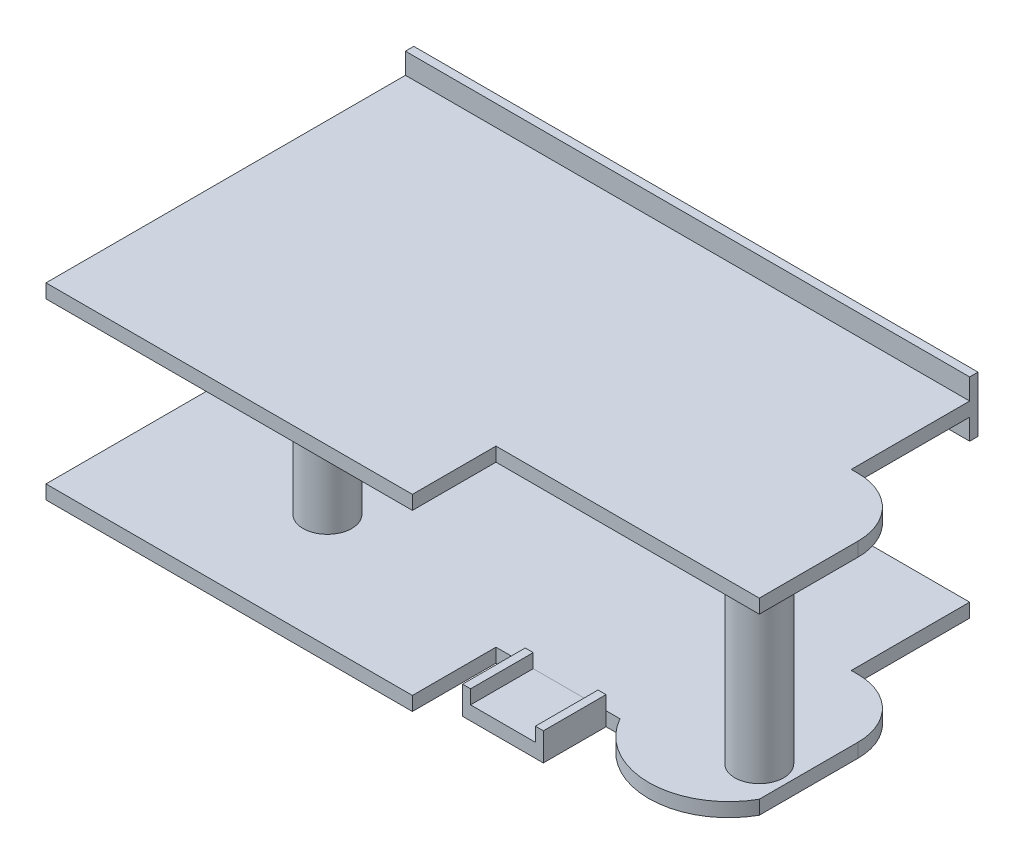
ISO-10303-21;
HEADER;
FILE_DESCRIPTION(('STEP AP214'),'2;1');
FILE_NAME('part.step','',(''),(''),'','','');
FILE_SCHEMA(('AUTOMOTIVE_DESIGN { 1 0 10303 214 1 1 1 1 }'));
ENDSEC;
DATA;
#1=APPLICATION_CONTEXT('core data for automotive mechanical design processes');
#2=APPLICATION_PROTOCOL_DEFINITION('international standard','automotive_design',2000,#1);
#3=PRODUCT_CONTEXT('',#1,'mechanical');
#4=PRODUCT('Part','Part','',(#3));
#5=PRODUCT_RELATED_PRODUCT_CATEGORY('part','',(#4));
#6=PRODUCT_DEFINITION_FORMATION('','',#4);
#7=PRODUCT_DEFINITION_CONTEXT('part definition',#1,'design');
#8=PRODUCT_DEFINITION('design','',#6,#7);
#9=PRODUCT_DEFINITION_SHAPE('','',#8);
#10=(LENGTH_UNIT() NAMED_UNIT(*) SI_UNIT(.MILLI.,.METRE.));
#11=(NAMED_UNIT(*) PLANE_ANGLE_UNIT() SI_UNIT($,.RADIAN.));
#12=(NAMED_UNIT(*) SI_UNIT($,.STERADIAN.) SOLID_ANGLE_UNIT());
#13=UNCERTAINTY_MEASURE_WITH_UNIT(LENGTH_MEASURE(1.E-05),#10,'distance_accuracy_value','');
#14=(GEOMETRIC_REPRESENTATION_CONTEXT(3) GLOBAL_UNCERTAINTY_ASSIGNED_CONTEXT((#13)) GLOBAL_UNIT_ASSIGNED_CONTEXT((#10,
#11,#12)) REPRESENTATION_CONTEXT('',''));
#15=CARTESIAN_POINT('',(0.,0.,0.));
#16=DIRECTION('',(0.,0.,1.));
#17=DIRECTION('',(1.,0.,0.));
#18=AXIS2_PLACEMENT_3D('',#15,#16,#17);
#19=CARTESIAN_POINT('',(289.75,10.,-15.));
#20=DIRECTION('',(0.,-1.,0.));
#21=DIRECTION('',(0.,0.,-1.));
#22=AXIS2_PLACEMENT_3D('',#19,#20,#21);
#23=PLANE('',#22);
#24=DIRECTION('',(-1.,0.,0.));
#25=VECTOR('',#24,1.);
#26=CARTESIAN_POINT('',(289.75,10.,-60.));
#27=LINE('',#26,#25);
#28=CARTESIAN_POINT('',(289.75,10.,-60.));
#29=VERTEX_POINT('',#28);
#30=CARTESIAN_POINT('',(284.,10.,-60.));
#31=VERTEX_POINT('',#30);
#32=EDGE_CURVE('E140',#29,#31,#27,.T.);
#33=ORIENTED_EDGE('',*,*,#32,.T.);
#34=DIRECTION('',(0.,0.,-1.));
#35=VECTOR('',#34,1.);
#36=CARTESIAN_POINT('',(284.,10.,-15.));
#37=LINE('',#36,#35);
#38=CARTESIAN_POINT('',(284.,10.,-15.));
#39=VERTEX_POINT('',#38);
#40=EDGE_CURVE('E12',#39,#31,#37,.T.);
#41=ORIENTED_EDGE('',*,*,#40,.F.);
#42=DIRECTION('',(-1.,0.,0.));
#43=VECTOR('',#42,1.);
#44=CARTESIAN_POINT('',(289.75,10.,-15.));
#45=LINE('',#44,#43);
#46=CARTESIAN_POINT('',(289.75,10.,-15.));
#47=VERTEX_POINT('',#46);
#48=EDGE_CURVE('E154',#47,#39,#45,.T.);
#49=ORIENTED_EDGE('',*,*,#48,.F.);
#50=DIRECTION('',(0.,0.,-1.));
#51=VECTOR('',#50,1.);
#52=CARTESIAN_POINT('',(289.75,10.,-15.));
#53=LINE('',#52,#51);
#54=EDGE_CURVE('E136',#47,#29,#53,.T.);
#55=ORIENTED_EDGE('',*,*,#54,.T.);
#56=EDGE_LOOP('',(#33,#41,#49,#55));
#57=FACE_BOUND('',#56,.T.);
#58=ADVANCED_FACE('F44',(#57),#23,.F.);
#59=CARTESIAN_POINT('',(284.,10.,-15.));
#60=DIRECTION('',(1.,0.,0.));
#61=DIRECTION('',(0.,0.,-1.));
#62=AXIS2_PLACEMENT_3D('',#59,#60,#61);
#63=PLANE('',#62);
#64=DIRECTION('',(0.,-1.,0.));
#65=VECTOR('',#64,1.);
#66=CARTESIAN_POINT('',(284.,10.,-60.));
#67=LINE('',#66,#65);
#68=CARTESIAN_POINT('',(284.,-10.,-60.));
#69=VERTEX_POINT('',#68);
#70=EDGE_CURVE('E143',#31,#69,#67,.T.);
#71=ORIENTED_EDGE('',*,*,#70,.T.);
#72=DIRECTION('',(0.,0.,-1.));
#73=VECTOR('',#72,1.);
#74=CARTESIAN_POINT('',(284.,-10.,-15.));
#75=LINE('',#74,#73);
#76=CARTESIAN_POINT('',(284.,-10.,-15.));
#77=VERTEX_POINT('',#76);
#78=EDGE_CURVE('E52',#77,#69,#75,.T.);
#79=ORIENTED_EDGE('',*,*,#78,.F.);
#80=DIRECTION('',(0.,-1.,0.));
#81=VECTOR('',#80,1.);
#82=CARTESIAN_POINT('',(284.,10.,-15.));
#83=LINE('',#82,#81);
#84=EDGE_CURVE('E103',#39,#77,#83,.T.);
#85=ORIENTED_EDGE('',*,*,#84,.F.);
#86=ORIENTED_EDGE('',*,*,#40,.T.);
#87=EDGE_LOOP('',(#71,#79,#85,#86));
#88=FACE_BOUND('',#87,.T.);
#89=ADVANCED_FACE('F189',(#88),#63,.F.);
#90=CARTESIAN_POINT('',(284.,-10.,-15.));
#91=DIRECTION('',(0.,1.,0.));
#92=DIRECTION('',(0.,0.,1.));
#93=AXIS2_PLACEMENT_3D('',#90,#91,#92);
#94=PLANE('',#93);
#95=DIRECTION('',(1.,0.,0.));
#96=VECTOR('',#95,1.);
#97=CARTESIAN_POINT('',(284.,-10.,-60.));
#98=LINE('',#97,#96);
#99=CARTESIAN_POINT('',(342.,-10.,-60.));
#100=VERTEX_POINT('',#99);
#101=EDGE_CURVE('E145',#69,#100,#98,.T.);
#102=ORIENTED_EDGE('',*,*,#101,.T.);
#103=DIRECTION('',(0.,0.,-1.));
#104=VECTOR('',#103,1.);
#105=CARTESIAN_POINT('',(342.,-10.,-15.));
#106=LINE('',#105,#104);
#107=CARTESIAN_POINT('',(342.,-10.,-15.));
#108=VERTEX_POINT('',#107);
#109=EDGE_CURVE('E161',#108,#100,#106,.T.);
#110=ORIENTED_EDGE('',*,*,#109,.F.);
#111=DIRECTION('',(1.,0.,0.));
#112=VECTOR('',#111,1.);
#113=CARTESIAN_POINT('',(284.,-10.,-15.));
#114=LINE('',#113,#112);
#115=EDGE_CURVE('E169',#77,#108,#114,.T.);
#116=ORIENTED_EDGE('',*,*,#115,.F.);
#117=ORIENTED_EDGE('',*,*,#78,.T.);
#118=EDGE_LOOP('',(#102,#110,#116,#117));
#119=FACE_BOUND('',#118,.T.);
#120=ADVANCED_FACE('F167',(#119),#94,.F.);
#121=CARTESIAN_POINT('',(342.,-10.,-15.));
#122=DIRECTION('',(-1.,0.,0.));
#123=DIRECTION('',(0.,0.,1.));
#124=AXIS2_PLACEMENT_3D('',#121,#122,#123);
#125=PLANE('',#124);
#126=DIRECTION('',(0.,1.,0.));
#127=VECTOR('',#126,1.);
#128=CARTESIAN_POINT('',(342.,-10.,-60.));
#129=LINE('',#128,#127);
#130=CARTESIAN_POINT('',(342.,10.,-60.));
#131=VERTEX_POINT('',#130);
#132=EDGE_CURVE('E147',#100,#131,#129,.T.);
#133=ORIENTED_EDGE('',*,*,#132,.T.);
#134=DIRECTION('',(0.,0.,-1.));
#135=VECTOR('',#134,1.);
#136=CARTESIAN_POINT('',(342.,10.,-15.));
#137=LINE('',#136,#135);
#138=CARTESIAN_POINT('',(342.,10.,-15.));
#139=VERTEX_POINT('',#138);
#140=EDGE_CURVE('E158',#139,#131,#137,.T.);
#141=ORIENTED_EDGE('',*,*,#140,.F.);
#142=DIRECTION('',(0.,1.,0.));
#143=VECTOR('',#142,1.);
#144=CARTESIAN_POINT('',(342.,-10.,-15.));
#145=LINE('',#144,#143);
#146=EDGE_CURVE('E181',#108,#139,#145,.T.);
#147=ORIENTED_EDGE('',*,*,#146,.F.);
#148=ORIENTED_EDGE('',*,*,#109,.T.);
#149=EDGE_LOOP('',(#133,#141,#147,#148));
#150=FACE_BOUND('',#149,.T.);
#151=ADVANCED_FACE('F177',(#150),#125,.F.);
#152=CARTESIAN_POINT('',(342.,10.,-15.));
#153=DIRECTION('',(0.,-1.,0.));
#154=DIRECTION('',(1.,0.,0.));
#155=AXIS2_PLACEMENT_3D('',#152,#153,#154);
#156=PLANE('',#155);
#157=DIRECTION('',(-1.,0.,0.));
#158=VECTOR('',#157,1.);
#159=CARTESIAN_POINT('',(342.,10.,-60.));
#160=LINE('',#159,#158);
#161=CARTESIAN_POINT('',(336.25,10.,-60.));
#162=VERTEX_POINT('',#161);
#163=EDGE_CURVE('E149',#131,#162,#160,.T.);
#164=ORIENTED_EDGE('',*,*,#163,.T.);
#165=DIRECTION('',(0.,0.,-1.));
#166=VECTOR('',#165,1.);
#167=CARTESIAN_POINT('',(336.25,10.,-15.));
#168=LINE('',#167,#166);
#169=CARTESIAN_POINT('',(336.25,10.,-15.));
#170=VERTEX_POINT('',#169);
#171=EDGE_CURVE('E131',#170,#162,#168,.T.);
#172=ORIENTED_EDGE('',*,*,#171,.F.);
#173=DIRECTION('',(-1.,0.,0.));
#174=VECTOR('',#173,1.);
#175=CARTESIAN_POINT('',(342.,10.,-15.));
#176=LINE('',#175,#174);
#177=EDGE_CURVE('E122',#139,#170,#176,.T.);
#178=ORIENTED_EDGE('',*,*,#177,.F.);
#179=ORIENTED_EDGE('',*,*,#140,.T.);
#180=EDGE_LOOP('',(#164,#172,#178,#179));
#181=FACE_BOUND('',#180,.T.);
#182=ADVANCED_FACE('F180',(#181),#156,.F.);
#183=CARTESIAN_POINT('',(336.25,10.,-15.));
#184=DIRECTION('',(1.,0.,0.));
#185=DIRECTION('',(0.,1.,0.));
#186=AXIS2_PLACEMENT_3D('',#183,#184,#185);
#187=PLANE('',#186);
#188=DIRECTION('',(0.,-1.,0.));
#189=VECTOR('',#188,1.);
#190=CARTESIAN_POINT('',(336.25,10.,-60.));
#191=LINE('',#190,#189);
#192=CARTESIAN_POINT('',(336.25,0.,-60.));
#193=VERTEX_POINT('',#192);
#194=EDGE_CURVE('E130',#162,#193,#191,.T.);
#195=ORIENTED_EDGE('',*,*,#194,.T.);
#196=DIRECTION('',(0.,0.,-1.));
#197=VECTOR('',#196,1.);
#198=CARTESIAN_POINT('',(336.25,0.,-15.));
#199=LINE('',#198,#197);
#200=CARTESIAN_POINT('',(336.25,0.,-15.));
#201=VERTEX_POINT('',#200);
#202=EDGE_CURVE('E127',#201,#193,#199,.T.);
#203=ORIENTED_EDGE('',*,*,#202,.F.);
#204=DIRECTION('',(0.,-1.,0.));
#205=VECTOR('',#204,1.);
#206=CARTESIAN_POINT('',(336.25,10.,-15.));
#207=LINE('',#206,#205);
#208=EDGE_CURVE('E116',#170,#201,#207,.T.);
#209=ORIENTED_EDGE('',*,*,#208,.F.);
#210=ORIENTED_EDGE('',*,*,#171,.T.);
#211=EDGE_LOOP('',(#195,#203,#209,#210));
#212=FACE_BOUND('',#211,.T.);
#213=ADVANCED_FACE('F128',(#212),#187,.F.);
#214=CARTESIAN_POINT('',(336.25,0.,-15.));
#215=DIRECTION('',(0.,-1.,0.));
#216=DIRECTION('',(0.,0.,-1.));
#217=AXIS2_PLACEMENT_3D('',#214,#215,#216);
#218=PLANE('',#217);
#219=DIRECTION('',(-1.,0.,0.));
#220=VECTOR('',#219,1.);
#221=CARTESIAN_POINT('',(336.25,0.,-60.));
#222=LINE('',#221,#220);
#223=CARTESIAN_POINT('',(289.75,0.,-60.));
#224=VERTEX_POINT('',#223);
#225=EDGE_CURVE('E89',#193,#224,#222,.T.);
#226=ORIENTED_EDGE('',*,*,#225,.T.);
#227=DIRECTION('',(0.,0.,-1.));
#228=VECTOR('',#227,1.);
#229=CARTESIAN_POINT('',(289.75,0.,-15.));
#230=LINE('',#229,#228);
#231=CARTESIAN_POINT('',(289.75,0.,-15.));
#232=VERTEX_POINT('',#231);
#233=EDGE_CURVE('E132',#232,#224,#230,.T.);
#234=ORIENTED_EDGE('',*,*,#233,.F.);
#235=DIRECTION('',(-1.,0.,0.));
#236=VECTOR('',#235,1.);
#237=CARTESIAN_POINT('',(336.25,0.,-15.));
#238=LINE('',#237,#236);
#239=EDGE_CURVE('E120',#201,#232,#238,.T.);
#240=ORIENTED_EDGE('',*,*,#239,.F.);
#241=ORIENTED_EDGE('',*,*,#202,.T.);
#242=EDGE_LOOP('',(#226,#234,#240,#241));
#243=FACE_BOUND('',#242,.T.);
#244=ADVANCED_FACE('F134',(#243),#218,.F.);
#245=CARTESIAN_POINT('',(289.75,0.,-15.));
#246=DIRECTION('',(-1.,0.,0.));
#247=DIRECTION('',(0.,0.,1.));
#248=AXIS2_PLACEMENT_3D('',#245,#246,#247);
#249=PLANE('',#248);
#250=DIRECTION('',(0.,1.,0.));
#251=VECTOR('',#250,1.);
#252=CARTESIAN_POINT('',(289.75,0.,-60.));
#253=LINE('',#252,#251);
#254=EDGE_CURVE('E95',#224,#29,#253,.T.);
#255=ORIENTED_EDGE('',*,*,#254,.T.);
#256=ORIENTED_EDGE('',*,*,#54,.F.);
#257=DIRECTION('',(0.,1.,0.));
#258=VECTOR('',#257,1.);
#259=CARTESIAN_POINT('',(289.75,0.,-15.));
#260=LINE('',#259,#258);
#261=EDGE_CURVE('E60',#232,#47,#260,.T.);
#262=ORIENTED_EDGE('',*,*,#261,.F.);
#263=ORIENTED_EDGE('',*,*,#233,.T.);
#264=EDGE_LOOP('',(#255,#256,#262,#263));
#265=FACE_BOUND('',#264,.T.);
#266=ADVANCED_FACE('F205',(#265),#249,.F.);
#267=CARTESIAN_POINT('',(0.,0.,-15.));
#268=DIRECTION('',(0.,0.,1.));
#269=DIRECTION('',(1.,0.,0.));
#270=AXIS2_PLACEMENT_3D('',#267,#268,#269);
#271=PLANE('',#270);
#272=ORIENTED_EDGE('',*,*,#48,.T.);
#273=ORIENTED_EDGE('',*,*,#84,.T.);
#274=ORIENTED_EDGE('',*,*,#115,.T.);
#275=ORIENTED_EDGE('',*,*,#146,.T.);
#276=ORIENTED_EDGE('',*,*,#177,.T.);
#277=ORIENTED_EDGE('',*,*,#208,.T.);
#278=ORIENTED_EDGE('',*,*,#239,.T.);
#279=ORIENTED_EDGE('',*,*,#261,.T.);
#280=EDGE_LOOP('',(#272,#273,#274,#275,#276,#277,#278,#279));
#281=FACE_BOUND('',#280,.T.);
#282=ADVANCED_FACE('F118',(#281),#271,.T.);
#283=CARTESIAN_POINT('',(0.,0.,-60.));
#284=DIRECTION('',(0.,0.,1.));
#285=DIRECTION('',(1.,0.,0.));
#286=AXIS2_PLACEMENT_3D('',#283,#284,#285);
#287=PLANE('',#286);
#288=ORIENTED_EDGE('',*,*,#32,.F.);
#289=ORIENTED_EDGE('',*,*,#254,.F.);
#290=ORIENTED_EDGE('',*,*,#225,.F.);
#291=ORIENTED_EDGE('',*,*,#194,.F.);
#292=ORIENTED_EDGE('',*,*,#163,.F.);
#293=ORIENTED_EDGE('',*,*,#132,.F.);
#294=ORIENTED_EDGE('',*,*,#101,.F.);
#295=ORIENTED_EDGE('',*,*,#70,.F.);
#296=EDGE_LOOP('',(#288,#289,#290,#291,#292,#293,#294,#295));
#297=FACE_BOUND('',#296,.T.);
#298=ADVANCED_FACE('F173',(#297),#287,.F.);
#299=CLOSED_SHELL('',(#58,#89,#120,#151,#182,#213,#244,#266,#282,#298));
#300=MANIFOLD_SOLID_BREP('B2',#299);
#301=CARTESIAN_POINT('',(263.,-10.,-60.));
#302=DIRECTION('',(0.,0.,1.));
#303=DIRECTION('',(1.,0.,0.));
#304=AXIS2_PLACEMENT_3D('',#301,#302,#303);
#305=PLANE('',#304);
#306=DIRECTION('',(0.,1.,0.));
#307=VECTOR('',#306,1.);
#308=CARTESIAN_POINT('',(352.,-114.205820724447,-60.));
#309=LINE('',#308,#307);
#310=CARTESIAN_POINT('',(352.,-9.99999999999999,-60.));
#311=VERTEX_POINT('',#310);
#312=CARTESIAN_POINT('',(352.,0.,-60.));
#313=VERTEX_POINT('',#312);
#314=EDGE_CURVE('E453',#311,#313,#309,.T.);
#315=ORIENTED_EDGE('',*,*,#314,.T.);
#316=DIRECTION('',(1.,0.,0.));
#317=VECTOR('',#316,1.);
#318=CARTESIAN_POINT('',(263.,0.,-60.));
#319=LINE('',#318,#317);
#320=CARTESIAN_POINT('',(263.,0.,-60.));
#321=VERTEX_POINT('',#320);
#322=EDGE_CURVE('E559',#321,#313,#319,.T.);
#323=ORIENTED_EDGE('',*,*,#322,.F.);
#324=DIRECTION('',(0.,1.,0.));
#325=VECTOR('',#324,1.);
#326=CARTESIAN_POINT('',(263.,-10.,-60.));
#327=LINE('',#326,#325);
#328=CARTESIAN_POINT('',(263.,-10.,-60.));
#329=VERTEX_POINT('',#328);
#330=EDGE_CURVE('E608',#329,#321,#327,.T.);
#331=ORIENTED_EDGE('',*,*,#330,.F.);
#332=DIRECTION('',(1.,0.,0.));
#333=VECTOR('',#332,1.);
#334=CARTESIAN_POINT('',(263.,-10.,-60.));
#335=LINE('',#334,#333);
#336=EDGE_CURVE('E562',#329,#311,#335,.T.);
#337=ORIENTED_EDGE('',*,*,#336,.T.);
#338=EDGE_LOOP('',(#315,#323,#331,#337));
#339=FACE_BOUND('',#338,.T.);
#340=ADVANCED_FACE('F271',(#339),#305,.T.);
#341=CARTESIAN_POINT('',(263.,-10.,0.));
#342=DIRECTION('',(1.,0.,0.));
#343=DIRECTION('',(0.,0.,-1.));
#344=AXIS2_PLACEMENT_3D('',#341,#342,#343);
#345=PLANE('',#344);
#346=DIRECTION('',(0.,0.,-1.));
#347=VECTOR('',#346,1.);
#348=CARTESIAN_POINT('',(263.,0.,0.));
#349=LINE('',#348,#347);
#350=CARTESIAN_POINT('',(263.,0.,0.));
#351=VERTEX_POINT('',#350);
#352=EDGE_CURVE('E566',#351,#321,#349,.T.);
#353=ORIENTED_EDGE('',*,*,#352,.F.);
#354=DIRECTION('',(0.,1.,0.));
#355=VECTOR('',#354,1.);
#356=CARTESIAN_POINT('',(263.,-10.,0.));
#357=LINE('',#356,#355);
#358=CARTESIAN_POINT('',(263.,-10.,0.));
#359=VERTEX_POINT('',#358);
#360=EDGE_CURVE('E611',#359,#351,#357,.T.);
#361=ORIENTED_EDGE('',*,*,#360,.F.);
#362=DIRECTION('',(0.,0.,-1.));
#363=VECTOR('',#362,1.);
#364=CARTESIAN_POINT('',(263.,-10.,0.));
#365=LINE('',#364,#363);
#366=EDGE_CURVE('E583',#359,#329,#365,.T.);
#367=ORIENTED_EDGE('',*,*,#366,.T.);
#368=ORIENTED_EDGE('',*,*,#330,.T.);
#369=EDGE_LOOP('',(#353,#361,#367,#368));
#370=FACE_BOUND('',#369,.T.);
#371=ADVANCED_FACE('F666',(#370),#345,.T.);
#372=CARTESIAN_POINT('',(0.,-10.,0.));
#373=DIRECTION('',(0.,0.,1.));
#374=DIRECTION('',(1.,0.,0.));
#375=AXIS2_PLACEMENT_3D('',#372,#373,#374);
#376=PLANE('',#375);
#377=DIRECTION('',(1.,0.,0.));
#378=VECTOR('',#377,1.);
#379=CARTESIAN_POINT('',(0.,0.,0.));
#380=LINE('',#379,#378);
#381=CARTESIAN_POINT('',(0.,0.,0.));
#382=VERTEX_POINT('',#381);
#383=EDGE_CURVE('E603',#382,#351,#380,.T.);
#384=ORIENTED_EDGE('',*,*,#383,.F.);
#385=DIRECTION('',(0.,1.,0.));
#386=VECTOR('',#385,1.);
#387=CARTESIAN_POINT('',(0.,-10.,0.));
#388=LINE('',#387,#386);
#389=CARTESIAN_POINT('',(0.,-10.,0.));
#390=VERTEX_POINT('',#389);
#391=EDGE_CURVE('E613',#390,#382,#388,.T.);
#392=ORIENTED_EDGE('',*,*,#391,.F.);
#393=DIRECTION('',(1.,0.,0.));
#394=VECTOR('',#393,1.);
#395=CARTESIAN_POINT('',(0.,-10.,0.));
#396=LINE('',#395,#394);
#397=EDGE_CURVE('E580',#390,#359,#396,.T.);
#398=ORIENTED_EDGE('',*,*,#397,.T.);
#399=ORIENTED_EDGE('',*,*,#360,.T.);
#400=EDGE_LOOP('',(#384,#392,#398,#399));
#401=FACE_BOUND('',#400,.T.);
#402=ADVANCED_FACE('F672',(#401),#376,.T.);
#403=CARTESIAN_POINT('',(0.,-10.,0.));
#404=DIRECTION('',(-1.,0.,0.));
#405=DIRECTION('',(0.,0.,1.));
#406=AXIS2_PLACEMENT_3D('',#403,#404,#405);
#407=PLANE('',#406);
#408=DIRECTION('',(0.,0.,1.));
#409=VECTOR('',#408,1.);
#410=CARTESIAN_POINT('',(0.,0.,0.));
#411=LINE('',#410,#409);
#412=CARTESIAN_POINT('',(0.,0.,-258.));
#413=VERTEX_POINT('',#412);
#414=EDGE_CURVE('E600',#413,#382,#411,.T.);
#415=ORIENTED_EDGE('',*,*,#414,.F.);
#416=DIRECTION('',(0.,1.,0.));
#417=VECTOR('',#416,1.);
#418=CARTESIAN_POINT('',(0.,-10.,-258.));
#419=LINE('',#418,#417);
#420=CARTESIAN_POINT('',(0.,-10.,-258.));
#421=VERTEX_POINT('',#420);
#422=EDGE_CURVE('E615',#421,#413,#419,.T.);
#423=ORIENTED_EDGE('',*,*,#422,.F.);
#424=DIRECTION('',(0.,0.,1.));
#425=VECTOR('',#424,1.);
#426=CARTESIAN_POINT('',(0.,-10.,0.));
#427=LINE('',#426,#425);
#428=EDGE_CURVE('E577',#421,#390,#427,.T.);
#429=ORIENTED_EDGE('',*,*,#428,.T.);
#430=ORIENTED_EDGE('',*,*,#391,.T.);
#431=EDGE_LOOP('',(#415,#423,#429,#430));
#432=FACE_BOUND('',#431,.T.);
#433=ADVANCED_FACE('F755',(#432),#407,.T.);
#434=CARTESIAN_POINT('',(0.,-10.,-258.));
#435=DIRECTION('',(0.,0.,-1.));
#436=DIRECTION('',(-1.,0.,0.));
#437=AXIS2_PLACEMENT_3D('',#434,#435,#436);
#438=PLANE('',#437);
#439=DIRECTION('',(-1.,0.,0.));
#440=VECTOR('',#439,1.);
#441=CARTESIAN_POINT('',(0.,0.,-258.));
#442=LINE('',#441,#440);
#443=CARTESIAN_POINT('',(405.,0.,-258.));
#444=VERTEX_POINT('',#443);
#445=EDGE_CURVE('E597',#444,#413,#442,.T.);
#446=ORIENTED_EDGE('',*,*,#445,.F.);
#447=DIRECTION('',(0.,1.,0.));
#448=VECTOR('',#447,1.);
#449=CARTESIAN_POINT('',(405.,-10.,-258.));
#450=LINE('',#449,#448);
#451=CARTESIAN_POINT('',(405.,-10.,-258.));
#452=VERTEX_POINT('',#451);
#453=EDGE_CURVE('E617',#452,#444,#450,.T.);
#454=ORIENTED_EDGE('',*,*,#453,.F.);
#455=DIRECTION('',(-1.,0.,0.));
#456=VECTOR('',#455,1.);
#457=CARTESIAN_POINT('',(0.,-10.,-258.));
#458=LINE('',#457,#456);
#459=EDGE_CURVE('E574',#452,#421,#458,.T.);
#460=ORIENTED_EDGE('',*,*,#459,.T.);
#461=ORIENTED_EDGE('',*,*,#422,.T.);
#462=EDGE_LOOP('',(#446,#454,#460,#461));
#463=FACE_BOUND('',#462,.T.);
#464=ADVANCED_FACE('F759',(#463),#438,.T.);
#465=CARTESIAN_POINT('',(405.,-10.,-258.));
#466=DIRECTION('',(1.,0.,0.));
#467=DIRECTION('',(0.,0.,-1.));
#468=AXIS2_PLACEMENT_3D('',#465,#466,#467);
#469=PLANE('',#468);
#470=DIRECTION('',(0.,0.,-1.));
#471=VECTOR('',#470,1.);
#472=CARTESIAN_POINT('',(405.,0.,-258.));
#473=LINE('',#472,#471);
#474=CARTESIAN_POINT('',(405.,0.,-173.));
#475=VERTEX_POINT('',#474);
#476=EDGE_CURVE('E594',#475,#444,#473,.T.);
#477=ORIENTED_EDGE('',*,*,#476,.F.);
#478=DIRECTION('',(0.,1.,0.));
#479=VECTOR('',#478,1.);
#480=CARTESIAN_POINT('',(405.,-10.,-173.));
#481=LINE('',#480,#479);
#482=CARTESIAN_POINT('',(405.,-10.,-173.));
#483=VERTEX_POINT('',#482);
#484=EDGE_CURVE('E619',#483,#475,#481,.T.);
#485=ORIENTED_EDGE('',*,*,#484,.F.);
#486=DIRECTION('',(0.,0.,-1.));
#487=VECTOR('',#486,1.);
#488=CARTESIAN_POINT('',(405.,-10.,-258.));
#489=LINE('',#488,#487);
#490=EDGE_CURVE('E571',#483,#452,#489,.T.);
#491=ORIENTED_EDGE('',*,*,#490,.T.);
#492=ORIENTED_EDGE('',*,*,#453,.T.);
#493=EDGE_LOOP('',(#477,#485,#491,#492));
#494=FACE_BOUND('',#493,.T.);
#495=ADVANCED_FACE('F763',(#494),#469,.T.);
#496=CARTESIAN_POINT('',(405.,-10.,-173.));
#497=DIRECTION('',(0.,0.,-1.));
#498=DIRECTION('',(-1.,0.,0.));
#499=AXIS2_PLACEMENT_3D('',#496,#497,#498);
#500=PLANE('',#499);
#501=DIRECTION('',(-1.,0.,0.));
#502=VECTOR('',#501,1.);
#503=CARTESIAN_POINT('',(405.,0.,-173.));
#504=LINE('',#503,#502);
#505=CARTESIAN_POINT('',(410.,0.,-173.));
#506=VERTEX_POINT('',#505);
#507=EDGE_CURVE('E592',#506,#475,#504,.T.);
#508=ORIENTED_EDGE('',*,*,#507,.F.);
#509=DIRECTION('',(0.,1.,0.));
#510=VECTOR('',#509,1.);
#511=CARTESIAN_POINT('',(410.,-10.,-173.));
#512=LINE('',#511,#510);
#513=CARTESIAN_POINT('',(410.,-10.,-173.));
#514=VERTEX_POINT('',#513);
#515=EDGE_CURVE('E628',#506,#514,#512,.F.);
#516=ORIENTED_EDGE('',*,*,#515,.T.);
#517=DIRECTION('',(-1.,0.,0.));
#518=VECTOR('',#517,1.);
#519=CARTESIAN_POINT('',(405.,-10.,-173.));
#520=LINE('',#519,#518);
#521=EDGE_CURVE('E569',#514,#483,#520,.T.);
#522=ORIENTED_EDGE('',*,*,#521,.T.);
#523=ORIENTED_EDGE('',*,*,#484,.T.);
#524=EDGE_LOOP('',(#508,#516,#522,#523));
#525=FACE_BOUND('',#524,.T.);
#526=ADVANCED_FACE('F766',(#525),#500,.T.);
#527=CARTESIAN_POINT('',(452.,-10.,-60.));
#528=DIRECTION('',(1.,0.,0.));
#529=DIRECTION('',(0.,0.,-1.));
#530=AXIS2_PLACEMENT_3D('',#527,#528,#529);
#531=PLANE('',#530);
#532=DIRECTION('',(0.,0.,-1.));
#533=VECTOR('',#532,1.);
#534=CARTESIAN_POINT('',(452.,-10.,-60.));
#535=LINE('',#534,#533);
#536=CARTESIAN_POINT('',(452.,-9.99999999999999,-60.));
#537=VERTEX_POINT('',#536);
#538=CARTESIAN_POINT('',(452.,-10.,-131.));
#539=VERTEX_POINT('',#538);
#540=EDGE_CURVE('E565',#537,#539,#535,.T.);
#541=ORIENTED_EDGE('',*,*,#540,.T.);
#542=DIRECTION('',(0.,1.,0.));
#543=VECTOR('',#542,1.);
#544=CARTESIAN_POINT('',(452.,-10.,-131.));
#545=LINE('',#544,#543);
#546=CARTESIAN_POINT('',(452.,0.,-131.));
#547=VERTEX_POINT('',#546);
#548=EDGE_CURVE('E610',#539,#547,#545,.T.);
#549=ORIENTED_EDGE('',*,*,#548,.T.);
#550=DIRECTION('',(0.,0.,-1.));
#551=VECTOR('',#550,1.);
#552=CARTESIAN_POINT('',(452.,0.,-60.));
#553=LINE('',#552,#551);
#554=CARTESIAN_POINT('',(452.,0.,-60.));
#555=VERTEX_POINT('',#554);
#556=EDGE_CURVE('E589',#555,#547,#553,.T.);
#557=ORIENTED_EDGE('',*,*,#556,.F.);
#558=DIRECTION('',(0.,1.,0.));
#559=VECTOR('',#558,1.);
#560=CARTESIAN_POINT('',(452.,-10.,-60.));
#561=LINE('',#560,#559);
#562=EDGE_CURVE('E586',#537,#555,#561,.T.);
#563=ORIENTED_EDGE('',*,*,#562,.F.);
#564=EDGE_LOOP('',(#541,#549,#557,#563));
#565=FACE_BOUND('',#564,.T.);
#566=ADVANCED_FACE('F677',(#565),#531,.T.);
#567=CARTESIAN_POINT('',(0.,-10.,0.));
#568=DIRECTION('',(0.,1.,0.));
#569=DIRECTION('',(0.,0.,1.));
#570=AXIS2_PLACEMENT_3D('',#567,#568,#569);
#571=PLANE('',#570);
#572=ORIENTED_EDGE('',*,*,#521,.F.);
#573=CARTESIAN_POINT('',(410.,-10.,-131.));
#574=DIRECTION('',(0.,1.,0.));
#575=DIRECTION('',(0.,0.,1.));
#576=AXIS2_PLACEMENT_3D('',#573,#574,#575);
#577=CIRCLE('',#576,42.);
#578=EDGE_CURVE('E630',#514,#539,#577,.F.);
#579=ORIENTED_EDGE('',*,*,#578,.T.);
#580=ORIENTED_EDGE('',*,*,#540,.F.);
#581=CARTESIAN_POINT('',(402.,-9.99999999999999,-88.));
#582=DIRECTION('',(0.,1.,0.));
#583=DIRECTION('',(0.,0.,1.));
#584=AXIS2_PLACEMENT_3D('',#581,#582,#583);
#585=CIRCLE('',#584,57.3061951275776);
#586=EDGE_CURVE('E646',#537,#311,#585,.F.);
#587=ORIENTED_EDGE('',*,*,#586,.T.);
#588=ORIENTED_EDGE('',*,*,#336,.F.);
#589=ORIENTED_EDGE('',*,*,#366,.F.);
#590=ORIENTED_EDGE('',*,*,#397,.F.);
#591=ORIENTED_EDGE('',*,*,#428,.F.);
#592=ORIENTED_EDGE('',*,*,#459,.F.);
#593=ORIENTED_EDGE('',*,*,#490,.F.);
#594=EDGE_LOOP('',(#572,#579,#580,#587,#588,#589,#590,#591,#592,#593));
#595=FACE_BOUND('',#594,.T.);
#596=ADVANCED_FACE('F695',(#595),#571,.F.);
#597=CARTESIAN_POINT('',(0.,0.,0.));
#598=DIRECTION('',(0.,1.,0.));
#599=DIRECTION('',(0.,0.,1.));
#600=AXIS2_PLACEMENT_3D('',#597,#598,#599);
#601=PLANE('',#600);
#602=CARTESIAN_POINT('',(430.,0.,-82.));
#603=DIRECTION('',(0.,1.,0.));
#604=DIRECTION('',(0.,0.,1.));
#605=AXIS2_PLACEMENT_3D('',#602,#603,#604);
#606=CIRCLE('',#605,17.5);
#607=CARTESIAN_POINT('',(430.,0.,-64.5));
#608=VERTEX_POINT('',#607);
#609=EDGE_CURVE('E549',#608,#608,#606,.T.);
#610=ORIENTED_EDGE('',*,*,#609,.F.);
#611=EDGE_LOOP('',(#610));
#612=FACE_BOUND('',#611,.T.);
#613=CARTESIAN_POINT('',(120.,0.,-82.));
#614=DIRECTION('',(0.,1.,0.));
#615=DIRECTION('',(0.,0.,1.));
#616=AXIS2_PLACEMENT_3D('',#613,#614,#615);
#617=CIRCLE('',#616,17.5);
#618=CARTESIAN_POINT('',(120.,0.,-64.5));
#619=VERTEX_POINT('',#618);
#620=EDGE_CURVE('E553',#619,#619,#617,.T.);
#621=ORIENTED_EDGE('',*,*,#620,.F.);
#622=EDGE_LOOP('',(#621));
#623=FACE_BOUND('',#622,.T.);
#624=ORIENTED_EDGE('',*,*,#556,.T.);
#625=CARTESIAN_POINT('',(410.,0.,-131.));
#626=DIRECTION('',(0.,1.,0.));
#627=DIRECTION('',(0.,0.,1.));
#628=AXIS2_PLACEMENT_3D('',#625,#626,#627);
#629=CIRCLE('',#628,42.);
#630=EDGE_CURVE('E626',#547,#506,#629,.T.);
#631=ORIENTED_EDGE('',*,*,#630,.T.);
#632=ORIENTED_EDGE('',*,*,#507,.T.);
#633=ORIENTED_EDGE('',*,*,#476,.T.);
#634=ORIENTED_EDGE('',*,*,#445,.T.);
#635=ORIENTED_EDGE('',*,*,#414,.T.);
#636=ORIENTED_EDGE('',*,*,#383,.T.);
#637=ORIENTED_EDGE('',*,*,#352,.T.);
#638=ORIENTED_EDGE('',*,*,#322,.T.);
#639=CARTESIAN_POINT('',(402.,0.,-88.));
#640=DIRECTION('',(0.,1.,0.));
#641=DIRECTION('',(0.,0.,1.));
#642=AXIS2_PLACEMENT_3D('',#639,#640,#641);
#643=CIRCLE('',#642,57.3061951275776);
#644=EDGE_CURVE('E451',#313,#555,#643,.T.);
#645=ORIENTED_EDGE('',*,*,#644,.T.);
#646=EDGE_LOOP('',(#624,#631,#632,#633,#634,#635,#636,#637,#638,#645));
#647=FACE_BOUND('',#646,.T.);
#648=ADVANCED_FACE('F746',(#612,#623,#647),#601,.T.);
#649=CARTESIAN_POINT('',(120.,115.,-82.));
#650=DIRECTION('',(0.,-1.,0.));
#651=DIRECTION('',(0.,0.,-1.));
#652=AXIS2_PLACEMENT_3D('',#649,#650,#651);
#653=CYLINDRICAL_SURFACE('',#652,17.5);
#654=CARTESIAN_POINT('',(120.,115.,-82.));
#655=DIRECTION('',(0.,1.,0.));
#656=DIRECTION('',(0.,0.,1.));
#657=AXIS2_PLACEMENT_3D('',#654,#655,#656);
#658=CIRCLE('',#657,17.5);
#659=CARTESIAN_POINT('',(120.,115.,-64.5));
#660=VERTEX_POINT('',#659);
#661=EDGE_CURVE('E556',#660,#660,#658,.T.);
#662=ORIENTED_EDGE('',*,*,#661,.F.);
#663=EDGE_LOOP('',(#662));
#664=FACE_BOUND('',#663,.T.);
#665=ORIENTED_EDGE('',*,*,#620,.T.);
#666=EDGE_LOOP('',(#665));
#667=FACE_BOUND('',#666,.T.);
#668=ADVANCED_FACE('F742',(#664,#667),#653,.T.);
#669=CARTESIAN_POINT('',(430.,115.,-82.));
#670=DIRECTION('',(0.,-1.,0.));
#671=DIRECTION('',(0.,0.,-1.));
#672=AXIS2_PLACEMENT_3D('',#669,#670,#671);
#673=CYLINDRICAL_SURFACE('',#672,17.5);
#674=CARTESIAN_POINT('',(430.,115.,-82.));
#675=DIRECTION('',(0.,1.,0.));
#676=DIRECTION('',(0.,0.,1.));
#677=AXIS2_PLACEMENT_3D('',#674,#675,#676);
#678=CIRCLE('',#677,17.5);
#679=CARTESIAN_POINT('',(430.,115.,-64.5));
#680=VERTEX_POINT('',#679);
#681=EDGE_CURVE('E550',#680,#680,#678,.T.);
#682=ORIENTED_EDGE('',*,*,#681,.F.);
#683=EDGE_LOOP('',(#682));
#684=FACE_BOUND('',#683,.T.);
#685=ORIENTED_EDGE('',*,*,#609,.T.);
#686=EDGE_LOOP('',(#685));
#687=FACE_BOUND('',#686,.T.);
#688=ADVANCED_FACE('F739',(#684,#687),#673,.T.);
#689=CARTESIAN_POINT('',(263.,125.,-60.));
#690=DIRECTION('',(0.,0.,-1.));
#691=DIRECTION('',(-1.,0.,0.));
#692=AXIS2_PLACEMENT_3D('',#689,#690,#691);
#693=PLANE('',#692);
#694=DIRECTION('',(1.,0.,0.));
#695=VECTOR('',#694,1.);
#696=CARTESIAN_POINT('',(263.,115.,-60.));
#697=LINE('',#696,#695);
#698=CARTESIAN_POINT('',(263.,115.,-60.));
#699=VERTEX_POINT('',#698);
#700=CARTESIAN_POINT('',(452.,115.,-60.));
#701=VERTEX_POINT('',#700);
#702=EDGE_CURVE('E643',#699,#701,#697,.T.);
#703=ORIENTED_EDGE('',*,*,#702,.T.);
#704=DIRECTION('',(0.,-1.,0.));
#705=VECTOR('',#704,1.);
#706=CARTESIAN_POINT('',(452.,125.,-60.));
#707=LINE('',#706,#705);
#708=CARTESIAN_POINT('',(452.,125.,-60.));
#709=VERTEX_POINT('',#708);
#710=EDGE_CURVE('E546',#709,#701,#707,.T.);
#711=ORIENTED_EDGE('',*,*,#710,.F.);
#712=DIRECTION('',(1.,0.,0.));
#713=VECTOR('',#712,1.);
#714=CARTESIAN_POINT('',(263.,125.,-60.));
#715=LINE('',#714,#713);
#716=CARTESIAN_POINT('',(263.,125.,-60.));
#717=VERTEX_POINT('',#716);
#718=EDGE_CURVE('E533',#717,#709,#715,.T.);
#719=ORIENTED_EDGE('',*,*,#718,.F.);
#720=DIRECTION('',(0.,-1.,0.));
#721=VECTOR('',#720,1.);
#722=CARTESIAN_POINT('',(263.,125.,-60.));
#723=LINE('',#722,#721);
#724=EDGE_CURVE('E534',#717,#699,#723,.T.);
#725=ORIENTED_EDGE('',*,*,#724,.T.);
#726=EDGE_LOOP('',(#703,#711,#719,#725));
#727=FACE_BOUND('',#726,.T.);
#728=ADVANCED_FACE('F712',(#727),#693,.F.);
#729=CARTESIAN_POINT('',(452.,125.,-60.));
#730=DIRECTION('',(-1.,0.,0.));
#731=DIRECTION('',(0.,0.,1.));
#732=AXIS2_PLACEMENT_3D('',#729,#730,#731);
#733=PLANE('',#732);
#734=DIRECTION('',(0.,0.,-1.));
#735=VECTOR('',#734,1.);
#736=CARTESIAN_POINT('',(452.,115.,-60.));
#737=LINE('',#736,#735);
#738=CARTESIAN_POINT('',(452.,115.,-131.));
#739=VERTEX_POINT('',#738);
#740=EDGE_CURVE('E645',#701,#739,#737,.T.);
#741=ORIENTED_EDGE('',*,*,#740,.T.);
#742=DIRECTION('',(0.,-1.,0.));
#743=VECTOR('',#742,1.);
#744=CARTESIAN_POINT('',(452.,125.,-131.));
#745=LINE('',#744,#743);
#746=CARTESIAN_POINT('',(452.,125.,-131.));
#747=VERTEX_POINT('',#746);
#748=EDGE_CURVE('E280',#739,#747,#745,.F.);
#749=ORIENTED_EDGE('',*,*,#748,.T.);
#750=DIRECTION('',(0.,0.,-1.));
#751=VECTOR('',#750,1.);
#752=CARTESIAN_POINT('',(452.,125.,-60.));
#753=LINE('',#752,#751);
#754=EDGE_CURVE('E509',#709,#747,#753,.T.);
#755=ORIENTED_EDGE('',*,*,#754,.F.);
#756=ORIENTED_EDGE('',*,*,#710,.T.);
#757=EDGE_LOOP('',(#741,#749,#755,#756));
#758=FACE_BOUND('',#757,.T.);
#759=ADVANCED_FACE('F709',(#758),#733,.F.);
#760=CARTESIAN_POINT('',(405.,125.,-173.));
#761=DIRECTION('',(0.,0.,1.));
#762=DIRECTION('',(1.,0.,0.));
#763=AXIS2_PLACEMENT_3D('',#760,#761,#762);
#764=PLANE('',#763);
#765=DIRECTION('',(-1.,0.,0.));
#766=VECTOR('',#765,1.);
#767=CARTESIAN_POINT('',(405.,125.,-173.));
#768=LINE('',#767,#766);
#769=CARTESIAN_POINT('',(410.,125.,-173.));
#770=VERTEX_POINT('',#769);
#771=CARTESIAN_POINT('',(405.,125.,-173.));
#772=VERTEX_POINT('',#771);
#773=EDGE_CURVE('E505',#770,#772,#768,.T.);
#774=ORIENTED_EDGE('',*,*,#773,.F.);
#775=DIRECTION('',(0.,-1.,0.));
#776=VECTOR('',#775,1.);
#777=CARTESIAN_POINT('',(410.,125.,-173.));
#778=LINE('',#777,#776);
#779=CARTESIAN_POINT('',(410.,115.,-173.));
#780=VERTEX_POINT('',#779);
#781=EDGE_CURVE('E632',#770,#780,#778,.T.);
#782=ORIENTED_EDGE('',*,*,#781,.T.);
#783=DIRECTION('',(-1.,0.,0.));
#784=VECTOR('',#783,1.);
#785=CARTESIAN_POINT('',(405.,115.,-173.));
#786=LINE('',#785,#784);
#787=CARTESIAN_POINT('',(405.,115.,-173.));
#788=VERTEX_POINT('',#787);
#789=EDGE_CURVE('E520',#780,#788,#786,.T.);
#790=ORIENTED_EDGE('',*,*,#789,.T.);
#791=DIRECTION('',(0.,-1.,0.));
#792=VECTOR('',#791,1.);
#793=CARTESIAN_POINT('',(405.,125.,-173.));
#794=LINE('',#793,#792);
#795=EDGE_CURVE('E544',#772,#788,#794,.T.);
#796=ORIENTED_EDGE('',*,*,#795,.F.);
#797=EDGE_LOOP('',(#774,#782,#790,#796));
#798=FACE_BOUND('',#797,.T.);
#799=ADVANCED_FACE('F648',(#798),#764,.F.);
#800=CARTESIAN_POINT('',(405.,125.,-258.));
#801=DIRECTION('',(-1.,0.,0.));
#802=DIRECTION('',(0.,0.,1.));
#803=AXIS2_PLACEMENT_3D('',#800,#801,#802);
#804=PLANE('',#803);
#805=DIRECTION('',(0.,0.,-1.));
#806=VECTOR('',#805,1.);
#807=CARTESIAN_POINT('',(405.,115.,-258.));
#808=LINE('',#807,#806);
#809=CARTESIAN_POINT('',(405.,115.,-258.));
#810=VERTEX_POINT('',#809);
#811=EDGE_CURVE('E517',#788,#810,#808,.T.);
#812=ORIENTED_EDGE('',*,*,#811,.T.);
#813=DIRECTION('',(0.,-1.,0.));
#814=VECTOR('',#813,1.);
#815=CARTESIAN_POINT('',(405.,100.,-258.));
#816=LINE('',#815,#814);
#817=CARTESIAN_POINT('',(405.,100.,-258.));
#818=VERTEX_POINT('',#817);
#819=EDGE_CURVE('E449',#810,#818,#816,.T.);
#820=ORIENTED_EDGE('',*,*,#819,.T.);
#821=DIRECTION('',(0.,0.,1.));
#822=VECTOR('',#821,1.);
#823=CARTESIAN_POINT('',(405.,100.,-264.));
#824=LINE('',#823,#822);
#825=CARTESIAN_POINT('',(405.,100.,-264.));
#826=VERTEX_POINT('',#825);
#827=EDGE_CURVE('E430',#826,#818,#824,.T.);
#828=ORIENTED_EDGE('',*,*,#827,.F.);
#829=DIRECTION('',(0.,-1.,0.));
#830=VECTOR('',#829,1.);
#831=CARTESIAN_POINT('',(405.,100.,-264.));
#832=LINE('',#831,#830);
#833=CARTESIAN_POINT('',(405.,140.,-264.));
#834=VERTEX_POINT('',#833);
#835=EDGE_CURVE('E436',#834,#826,#832,.T.);
#836=ORIENTED_EDGE('',*,*,#835,.F.);
#837=DIRECTION('',(0.,0.,1.));
#838=VECTOR('',#837,1.);
#839=CARTESIAN_POINT('',(405.,140.,-264.));
#840=LINE('',#839,#838);
#841=CARTESIAN_POINT('',(405.,140.,-258.));
#842=VERTEX_POINT('',#841);
#843=EDGE_CURVE('E494',#834,#842,#840,.T.);
#844=ORIENTED_EDGE('',*,*,#843,.T.);
#845=CARTESIAN_POINT('',(405.,125.,-258.));
#846=VERTEX_POINT('',#845);
#847=EDGE_CURVE('E459',#842,#846,#816,.T.);
#848=ORIENTED_EDGE('',*,*,#847,.T.);
#849=DIRECTION('',(0.,0.,-1.));
#850=VECTOR('',#849,1.);
#851=CARTESIAN_POINT('',(405.,125.,-258.));
#852=LINE('',#851,#850);
#853=EDGE_CURVE('E501',#772,#846,#852,.T.);
#854=ORIENTED_EDGE('',*,*,#853,.F.);
#855=ORIENTED_EDGE('',*,*,#795,.T.);
#856=EDGE_LOOP('',(#812,#820,#828,#836,#844,#848,#854,#855));
#857=FACE_BOUND('',#856,.T.);
#858=ADVANCED_FACE('F448',(#857),#804,.F.);
#859=CARTESIAN_POINT('',(0.,125.,0.));
#860=DIRECTION('',(1.,0.,0.));
#861=DIRECTION('',(0.,0.,-1.));
#862=AXIS2_PLACEMENT_3D('',#859,#860,#861);
#863=PLANE('',#862);
#864=DIRECTION('',(0.,0.,1.));
#865=VECTOR('',#864,1.);
#866=CARTESIAN_POINT('',(0.,115.,0.));
#867=LINE('',#866,#865);
#868=CARTESIAN_POINT('',(0.,115.,-258.));
#869=VERTEX_POINT('',#868);
#870=CARTESIAN_POINT('',(0.,115.,0.));
#871=VERTEX_POINT('',#870);
#872=EDGE_CURVE('E524',#869,#871,#867,.T.);
#873=ORIENTED_EDGE('',*,*,#872,.T.);
#874=DIRECTION('',(0.,-1.,0.));
#875=VECTOR('',#874,1.);
#876=CARTESIAN_POINT('',(0.,125.,0.));
#877=LINE('',#876,#875);
#878=CARTESIAN_POINT('',(0.,125.,0.));
#879=VERTEX_POINT('',#878);
#880=EDGE_CURVE('E541',#879,#871,#877,.T.);
#881=ORIENTED_EDGE('',*,*,#880,.F.);
#882=DIRECTION('',(0.,0.,1.));
#883=VECTOR('',#882,1.);
#884=CARTESIAN_POINT('',(0.,125.,0.));
#885=LINE('',#884,#883);
#886=CARTESIAN_POINT('',(0.,125.,-258.));
#887=VERTEX_POINT('',#886);
#888=EDGE_CURVE('E488',#887,#879,#885,.T.);
#889=ORIENTED_EDGE('',*,*,#888,.F.);
#890=DIRECTION('',(0.,1.,0.));
#891=VECTOR('',#890,1.);
#892=CARTESIAN_POINT('',(0.,100.,-258.));
#893=LINE('',#892,#891);
#894=CARTESIAN_POINT('',(0.,140.,-258.));
#895=VERTEX_POINT('',#894);
#896=EDGE_CURVE('E471',#887,#895,#893,.T.);
#897=ORIENTED_EDGE('',*,*,#896,.T.);
#898=DIRECTION('',(0.,0.,1.));
#899=VECTOR('',#898,1.);
#900=CARTESIAN_POINT('',(0.,140.,-264.));
#901=LINE('',#900,#899);
#902=CARTESIAN_POINT('',(0.,140.,-264.));
#903=VERTEX_POINT('',#902);
#904=EDGE_CURVE('E455',#903,#895,#901,.T.);
#905=ORIENTED_EDGE('',*,*,#904,.F.);
#906=DIRECTION('',(0.,1.,0.));
#907=VECTOR('',#906,1.);
#908=CARTESIAN_POINT('',(0.,100.,-264.));
#909=LINE('',#908,#907);
#910=CARTESIAN_POINT('',(0.,100.,-264.));
#911=VERTEX_POINT('',#910);
#912=EDGE_CURVE('E435',#911,#903,#909,.T.);
#913=ORIENTED_EDGE('',*,*,#912,.F.);
#914=DIRECTION('',(0.,0.,1.));
#915=VECTOR('',#914,1.);
#916=CARTESIAN_POINT('',(0.,100.,-264.));
#917=LINE('',#916,#915);
#918=CARTESIAN_POINT('',(0.,100.,-258.));
#919=VERTEX_POINT('',#918);
#920=EDGE_CURVE('E432',#911,#919,#917,.T.);
#921=ORIENTED_EDGE('',*,*,#920,.T.);
#922=EDGE_CURVE('E478',#919,#869,#893,.T.);
#923=ORIENTED_EDGE('',*,*,#922,.T.);
#924=EDGE_LOOP('',(#873,#881,#889,#897,#905,#913,#921,#923));
#925=FACE_BOUND('',#924,.T.);
#926=ADVANCED_FACE('F486',(#925),#863,.F.);
#927=CARTESIAN_POINT('',(0.,125.,0.));
#928=DIRECTION('',(0.,0.,-1.));
#929=DIRECTION('',(-1.,0.,0.));
#930=AXIS2_PLACEMENT_3D('',#927,#928,#929);
#931=PLANE('',#930);
#932=DIRECTION('',(1.,0.,0.));
#933=VECTOR('',#932,1.);
#934=CARTESIAN_POINT('',(0.,115.,0.));
#935=LINE('',#934,#933);
#936=CARTESIAN_POINT('',(263.,115.,0.));
#937=VERTEX_POINT('',#936);
#938=EDGE_CURVE('E529',#871,#937,#935,.T.);
#939=ORIENTED_EDGE('',*,*,#938,.T.);
#940=DIRECTION('',(0.,-1.,0.));
#941=VECTOR('',#940,1.);
#942=CARTESIAN_POINT('',(263.,125.,0.));
#943=LINE('',#942,#941);
#944=CARTESIAN_POINT('',(263.,125.,0.));
#945=VERTEX_POINT('',#944);
#946=EDGE_CURVE('E537',#945,#937,#943,.T.);
#947=ORIENTED_EDGE('',*,*,#946,.F.);
#948=DIRECTION('',(1.,0.,0.));
#949=VECTOR('',#948,1.);
#950=CARTESIAN_POINT('',(0.,125.,0.));
#951=LINE('',#950,#949);
#952=EDGE_CURVE('E640',#879,#945,#951,.T.);
#953=ORIENTED_EDGE('',*,*,#952,.F.);
#954=ORIENTED_EDGE('',*,*,#880,.T.);
#955=EDGE_LOOP('',(#939,#947,#953,#954));
#956=FACE_BOUND('',#955,.T.);
#957=ADVANCED_FACE('F721',(#956),#931,.F.);
#958=CARTESIAN_POINT('',(263.,125.,0.));
#959=DIRECTION('',(-1.,0.,0.));
#960=DIRECTION('',(0.,0.,1.));
#961=AXIS2_PLACEMENT_3D('',#958,#959,#960);
#962=PLANE('',#961);
#963=DIRECTION('',(0.,0.,-1.));
#964=VECTOR('',#963,1.);
#965=CARTESIAN_POINT('',(263.,115.,0.));
#966=LINE('',#965,#964);
#967=EDGE_CURVE('E531',#937,#699,#966,.T.);
#968=ORIENTED_EDGE('',*,*,#967,.T.);
#969=ORIENTED_EDGE('',*,*,#724,.F.);
#970=DIRECTION('',(0.,0.,-1.));
#971=VECTOR('',#970,1.);
#972=CARTESIAN_POINT('',(263.,125.,0.));
#973=LINE('',#972,#971);
#974=EDGE_CURVE('E538',#945,#717,#973,.T.);
#975=ORIENTED_EDGE('',*,*,#974,.F.);
#976=ORIENTED_EDGE('',*,*,#946,.T.);
#977=EDGE_LOOP('',(#968,#969,#975,#976));
#978=FACE_BOUND('',#977,.T.);
#979=ADVANCED_FACE('F716',(#978),#962,.F.);
#980=CARTESIAN_POINT('',(0.,125.,0.));
#981=DIRECTION('',(0.,1.,0.));
#982=DIRECTION('',(0.,0.,1.));
#983=AXIS2_PLACEMENT_3D('',#980,#981,#982);
#984=PLANE('',#983);
#985=ORIENTED_EDGE('',*,*,#754,.T.);
#986=CARTESIAN_POINT('',(410.,125.,-131.));
#987=DIRECTION('',(0.,1.,0.));
#988=DIRECTION('',(0.,0.,1.));
#989=AXIS2_PLACEMENT_3D('',#986,#987,#988);
#990=CIRCLE('',#989,42.);
#991=EDGE_CURVE('E42',#747,#770,#990,.T.);
#992=ORIENTED_EDGE('',*,*,#991,.T.);
#993=ORIENTED_EDGE('',*,*,#773,.T.);
#994=ORIENTED_EDGE('',*,*,#853,.T.);
#995=DIRECTION('',(-1.,0.,0.));
#996=VECTOR('',#995,1.);
#997=CARTESIAN_POINT('',(0.,125.,-258.));
#998=LINE('',#997,#996);
#999=EDGE_CURVE('E497',#846,#887,#998,.T.);
#1000=ORIENTED_EDGE('',*,*,#999,.T.);
#1001=ORIENTED_EDGE('',*,*,#888,.T.);
#1002=ORIENTED_EDGE('',*,*,#952,.T.);
#1003=ORIENTED_EDGE('',*,*,#974,.T.);
#1004=ORIENTED_EDGE('',*,*,#718,.T.);
#1005=EDGE_LOOP('',(#985,#992,#993,#994,#1000,#1001,#1002,#1003,#1004));
#1006=FACE_BOUND('',#1005,.T.);
#1007=ADVANCED_FACE('F503',(#1006),#984,.T.);
#1008=CARTESIAN_POINT('',(0.,115.,0.));
#1009=DIRECTION('',(0.,1.,0.));
#1010=DIRECTION('',(0.,0.,1.));
#1011=AXIS2_PLACEMENT_3D('',#1008,#1009,#1010);
#1012=PLANE('',#1011);
#1013=ORIENTED_EDGE('',*,*,#661,.T.);
#1014=EDGE_LOOP('',(#1013));
#1015=FACE_BOUND('',#1014,.T.);
#1016=ORIENTED_EDGE('',*,*,#681,.T.);
#1017=EDGE_LOOP('',(#1016));
#1018=FACE_BOUND('',#1017,.T.);
#1019=ORIENTED_EDGE('',*,*,#789,.F.);
#1020=CARTESIAN_POINT('',(410.,115.,-131.));
#1021=DIRECTION('',(0.,1.,0.));
#1022=DIRECTION('',(0.,0.,1.));
#1023=AXIS2_PLACEMENT_3D('',#1020,#1021,#1022);
#1024=CIRCLE('',#1023,42.);
#1025=EDGE_CURVE('E295',#780,#739,#1024,.F.);
#1026=ORIENTED_EDGE('',*,*,#1025,.T.);
#1027=ORIENTED_EDGE('',*,*,#740,.F.);
#1028=ORIENTED_EDGE('',*,*,#702,.F.);
#1029=ORIENTED_EDGE('',*,*,#967,.F.);
#1030=ORIENTED_EDGE('',*,*,#938,.F.);
#1031=ORIENTED_EDGE('',*,*,#872,.F.);
#1032=DIRECTION('',(-1.,0.,0.));
#1033=VECTOR('',#1032,1.);
#1034=CARTESIAN_POINT('',(0.,115.,-258.));
#1035=LINE('',#1034,#1033);
#1036=EDGE_CURVE('E519',#810,#869,#1035,.T.);
#1037=ORIENTED_EDGE('',*,*,#1036,.F.);
#1038=ORIENTED_EDGE('',*,*,#811,.F.);
#1039=EDGE_LOOP('',(#1019,#1026,#1027,#1028,#1029,#1030,#1031,#1037,#1038));
#1040=FACE_BOUND('',#1039,.T.);
#1041=ADVANCED_FACE('F652',(#1015,#1018,#1040),#1012,.F.);
#1042=CARTESIAN_POINT('',(410.,-10.,-131.));
#1043=DIRECTION('',(0.,1.,0.));
#1044=DIRECTION('',(0.,0.,1.));
#1045=AXIS2_PLACEMENT_3D('',#1042,#1043,#1044);
#1046=CYLINDRICAL_SURFACE('',#1045,42.);
#1047=ORIENTED_EDGE('',*,*,#578,.F.);
#1048=ORIENTED_EDGE('',*,*,#515,.F.);
#1049=ORIENTED_EDGE('',*,*,#630,.F.);
#1050=ORIENTED_EDGE('',*,*,#548,.F.);
#1051=EDGE_LOOP('',(#1047,#1048,#1049,#1050));
#1052=FACE_BOUND('',#1051,.T.);
#1053=ADVANCED_FACE('F679',(#1052),#1046,.T.);
#1054=CARTESIAN_POINT('',(410.,125.,-131.));
#1055=DIRECTION('',(0.,-1.,0.));
#1056=DIRECTION('',(0.,0.,-1.));
#1057=AXIS2_PLACEMENT_3D('',#1054,#1055,#1056);
#1058=CYLINDRICAL_SURFACE('',#1057,42.);
#1059=ORIENTED_EDGE('',*,*,#991,.F.);
#1060=ORIENTED_EDGE('',*,*,#748,.F.);
#1061=ORIENTED_EDGE('',*,*,#1025,.F.);
#1062=ORIENTED_EDGE('',*,*,#781,.F.);
#1063=EDGE_LOOP('',(#1059,#1060,#1061,#1062));
#1064=FACE_BOUND('',#1063,.T.);
#1065=ADVANCED_FACE('F273',(#1064),#1058,.T.);
#1066=CARTESIAN_POINT('',(402.,-114.205820724447,-88.));
#1067=DIRECTION('',(0.,1.,0.));
#1068=DIRECTION('',(0.,0.,1.));
#1069=AXIS2_PLACEMENT_3D('',#1066,#1067,#1068);
#1070=CYLINDRICAL_SURFACE('',#1069,57.3061951275776);
#1071=ORIENTED_EDGE('',*,*,#586,.F.);
#1072=ORIENTED_EDGE('',*,*,#562,.T.);
#1073=ORIENTED_EDGE('',*,*,#644,.F.);
#1074=ORIENTED_EDGE('',*,*,#314,.F.);
#1075=EDGE_LOOP('',(#1071,#1072,#1073,#1074));
#1076=FACE_BOUND('',#1075,.T.);
#1077=ADVANCED_FACE('F664',(#1076),#1070,.T.);
#1078=CARTESIAN_POINT('',(0.,0.,-258.));
#1079=DIRECTION('',(0.,0.,1.));
#1080=DIRECTION('',(1.,0.,0.));
#1081=AXIS2_PLACEMENT_3D('',#1078,#1079,#1080);
#1082=PLANE('',#1081);
#1083=ORIENTED_EDGE('',*,*,#999,.F.);
#1084=ORIENTED_EDGE('',*,*,#847,.F.);
#1085=DIRECTION('',(1.,0.,0.));
#1086=VECTOR('',#1085,1.);
#1087=CARTESIAN_POINT('',(405.,140.,-258.));
#1088=LINE('',#1087,#1086);
#1089=EDGE_CURVE('E445',#895,#842,#1088,.T.);
#1090=ORIENTED_EDGE('',*,*,#1089,.F.);
#1091=ORIENTED_EDGE('',*,*,#896,.F.);
#1092=EDGE_LOOP('',(#1083,#1084,#1090,#1091));
#1093=FACE_BOUND('',#1092,.T.);
#1094=ADVANCED_FACE('F496',(#1093),#1082,.T.);
#1095=CARTESIAN_POINT('',(405.,100.,-264.));
#1096=DIRECTION('',(0.,1.,0.));
#1097=DIRECTION('',(0.,0.,1.));
#1098=AXIS2_PLACEMENT_3D('',#1095,#1096,#1097);
#1099=PLANE('',#1098);
#1100=DIRECTION('',(-1.,0.,0.));
#1101=VECTOR('',#1100,1.);
#1102=CARTESIAN_POINT('',(405.,100.,-258.));
#1103=LINE('',#1102,#1101);
#1104=EDGE_CURVE('E463',#818,#919,#1103,.T.);
#1105=ORIENTED_EDGE('',*,*,#1104,.T.);
#1106=ORIENTED_EDGE('',*,*,#920,.F.);
#1107=DIRECTION('',(-1.,0.,0.));
#1108=VECTOR('',#1107,1.);
#1109=CARTESIAN_POINT('',(405.,100.,-264.));
#1110=LINE('',#1109,#1108);
#1111=EDGE_CURVE('E426',#826,#911,#1110,.T.);
#1112=ORIENTED_EDGE('',*,*,#1111,.F.);
#1113=ORIENTED_EDGE('',*,*,#827,.T.);
#1114=EDGE_LOOP('',(#1105,#1106,#1112,#1113));
#1115=FACE_BOUND('',#1114,.T.);
#1116=ADVANCED_FACE('F428',(#1115),#1099,.F.);
#1117=CARTESIAN_POINT('',(405.,140.,-264.));
#1118=DIRECTION('',(0.,-1.,0.));
#1119=DIRECTION('',(0.,0.,-1.));
#1120=AXIS2_PLACEMENT_3D('',#1117,#1118,#1119);
#1121=PLANE('',#1120);
#1122=ORIENTED_EDGE('',*,*,#1089,.T.);
#1123=ORIENTED_EDGE('',*,*,#843,.F.);
#1124=DIRECTION('',(1.,0.,0.));
#1125=VECTOR('',#1124,1.);
#1126=CARTESIAN_POINT('',(405.,140.,-264.));
#1127=LINE('',#1126,#1125);
#1128=EDGE_CURVE('E441',#903,#834,#1127,.T.);
#1129=ORIENTED_EDGE('',*,*,#1128,.F.);
#1130=ORIENTED_EDGE('',*,*,#904,.T.);
#1131=EDGE_LOOP('',(#1122,#1123,#1129,#1130));
#1132=FACE_BOUND('',#1131,.T.);
#1133=ADVANCED_FACE('F493',(#1132),#1121,.F.);
#1134=CARTESIAN_POINT('',(0.,0.,-264.));
#1135=DIRECTION('',(0.,0.,1.));
#1136=DIRECTION('',(1.,0.,0.));
#1137=AXIS2_PLACEMENT_3D('',#1134,#1135,#1136);
#1138=PLANE('',#1137);
#1139=ORIENTED_EDGE('',*,*,#835,.T.);
#1140=ORIENTED_EDGE('',*,*,#1111,.T.);
#1141=ORIENTED_EDGE('',*,*,#912,.T.);
#1142=ORIENTED_EDGE('',*,*,#1128,.T.);
#1143=EDGE_LOOP('',(#1139,#1140,#1141,#1142));
#1144=FACE_BOUND('',#1143,.T.);
#1145=ADVANCED_FACE('F439',(#1144),#1138,.F.);
#1146=ORIENTED_EDGE('',*,*,#819,.F.);
#1147=ORIENTED_EDGE('',*,*,#1036,.T.);
#1148=ORIENTED_EDGE('',*,*,#922,.F.);
#1149=ORIENTED_EDGE('',*,*,#1104,.F.);
#1150=EDGE_LOOP('',(#1146,#1147,#1148,#1149));
#1151=FACE_BOUND('',#1150,.T.);
#1152=ADVANCED_FACE('F655',(#1151),#1082,.T.);
#1153=CLOSED_SHELL('',(#340,#371,#402,#433,#464,#495,#526,#566,#596,#648,#668,#688,#728,#759,
#799,#858,#926,#957,#979,#1007,#1041,#1053,#1065,#1077,#1094,#1116,#1133,#1145,#1152));
#1154=MANIFOLD_SOLID_BREP('B6',#1153);
#1155=ADVANCED_BREP_SHAPE_REPRESENTATION('',(#18,#300,#1154),#14);
#1156=SHAPE_DEFINITION_REPRESENTATION(#9,#1155);
ENDSEC;
END-ISO-10303-21;
